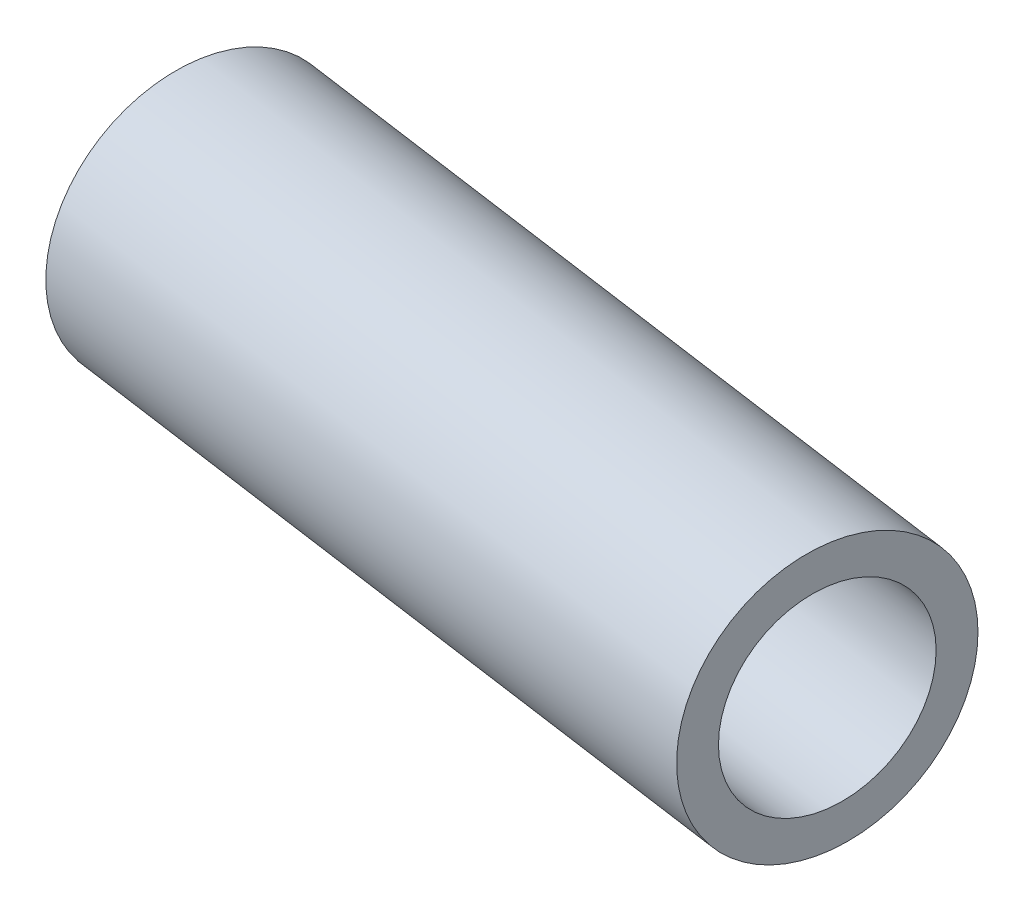
ISO-10303-21;
HEADER;
FILE_DESCRIPTION(('STEP AP214'),'2;1');
FILE_NAME('part.step','',(''),(''),'','','');
FILE_SCHEMA(('AUTOMOTIVE_DESIGN { 1 0 10303 214 1 1 1 1 }'));
ENDSEC;
DATA;
#1=APPLICATION_CONTEXT('core data for automotive mechanical design processes');
#2=APPLICATION_PROTOCOL_DEFINITION('international standard','automotive_design',2000,#1);
#3=PRODUCT_CONTEXT('',#1,'mechanical');
#4=PRODUCT('Part','Part','',(#3));
#5=PRODUCT_RELATED_PRODUCT_CATEGORY('part','',(#4));
#6=PRODUCT_DEFINITION_FORMATION('','',#4);
#7=PRODUCT_DEFINITION_CONTEXT('part definition',#1,'design');
#8=PRODUCT_DEFINITION('design','',#6,#7);
#9=PRODUCT_DEFINITION_SHAPE('','',#8);
#10=(LENGTH_UNIT() NAMED_UNIT(*) SI_UNIT(.MILLI.,.METRE.));
#11=(NAMED_UNIT(*) PLANE_ANGLE_UNIT() SI_UNIT($,.RADIAN.));
#12=(NAMED_UNIT(*) SI_UNIT($,.STERADIAN.) SOLID_ANGLE_UNIT());
#13=UNCERTAINTY_MEASURE_WITH_UNIT(LENGTH_MEASURE(1.E-05),#10,'distance_accuracy_value','');
#14=(GEOMETRIC_REPRESENTATION_CONTEXT(3) GLOBAL_UNCERTAINTY_ASSIGNED_CONTEXT((#13)) GLOBAL_UNIT_ASSIGNED_CONTEXT((#10,
#11,#12)) REPRESENTATION_CONTEXT('',''));
#15=CARTESIAN_POINT('',(0.,0.,0.));
#16=DIRECTION('',(0.,0.,1.));
#17=DIRECTION('',(1.,0.,0.));
#18=AXIS2_PLACEMENT_3D('',#15,#16,#17);
#19=CARTESIAN_POINT('',(-68.2944341838773,-23.74921875,-426.218870209722));
#20=DIRECTION('',(0.990268068741571,0.,0.139173100960058));
#21=DIRECTION('',(0.139173100960058,0.,-0.990268068741571));
#22=AXIS2_PLACEMENT_3D('',#19,#20,#21);
#23=CYLINDRICAL_SURFACE('',#22,5.40078125001179);
#24=CARTESIAN_POINT('',(-68.2944341838773,-23.74921875,-426.218870209722));
#25=DIRECTION('',(0.990268068741571,0.,0.139173100960058));
#26=DIRECTION('',(0.139173100960058,0.,-0.990268068741571));
#27=AXIS2_PLACEMENT_3D('',#24,#25,#26);
#28=CIRCLE('',#27,5.40078125001179);
#29=CARTESIAN_POINT('',(-67.5427907097062,-23.74921875,-431.567091427866));
#30=VERTEX_POINT('',#29);
#31=EDGE_CURVE('E11',#30,#30,#28,.T.);
#32=ORIENTED_EDGE('',*,*,#31,.T.);
#33=EDGE_LOOP('',(#32));
#34=FACE_BOUND('',#33,.T.);
#35=CARTESIAN_POINT('',(-38.5863921216302,-23.74921875,-422.04367718092));
#36=DIRECTION('',(0.990268068741571,0.,0.139173100960058));
#37=DIRECTION('',(0.139173100960058,0.,-0.990268068741571));
#38=AXIS2_PLACEMENT_3D('',#35,#36,#37);
#39=CIRCLE('',#38,5.40078125001179);
#40=CARTESIAN_POINT('',(-37.8347486474591,-23.74921875,-427.391898399065));
#41=VERTEX_POINT('',#40);
#42=EDGE_CURVE('E48',#41,#41,#39,.T.);
#43=ORIENTED_EDGE('',*,*,#42,.F.);
#44=EDGE_LOOP('',(#43));
#45=FACE_BOUND('',#44,.T.);
#46=ADVANCED_FACE('F45',(#34,#45),#23,.T.);
#47=CARTESIAN_POINT('',(-68.2944341838773,-23.74921875,-426.218870209722));
#48=DIRECTION('',(0.990268068741571,0.,0.139173100960058));
#49=DIRECTION('',(0.139173100960058,0.,-0.990268068741571));
#50=AXIS2_PLACEMENT_3D('',#47,#48,#49);
#51=PLANE('',#50);
#52=CARTESIAN_POINT('',(-68.2944341838773,-23.74921875,-426.218870209722));
#53=DIRECTION('',(0.990268068741571,0.,0.139173100960058));
#54=DIRECTION('',(0.139173100960058,0.,-0.990268068741571));
#55=AXIS2_PLACEMENT_3D('',#52,#53,#54);
#56=CIRCLE('',#55,3.90078124999991);
#57=CARTESIAN_POINT('',(-67.751550361148,-23.74921875,-430.081689324742));
#58=VERTEX_POINT('',#57);
#59=EDGE_CURVE('E55',#58,#58,#56,.T.);
#60=ORIENTED_EDGE('',*,*,#59,.T.);
#61=EDGE_LOOP('',(#60));
#62=FACE_BOUND('',#61,.T.);
#63=ORIENTED_EDGE('',*,*,#31,.F.);
#64=EDGE_LOOP('',(#63));
#65=FACE_BOUND('',#64,.T.);
#66=ADVANCED_FACE('F63',(#62,#65),#51,.F.);
#67=CARTESIAN_POINT('',(-38.5863921216302,-23.74921875,-422.04367718092));
#68=DIRECTION('',(0.990268068741571,0.,0.139173100960058));
#69=DIRECTION('',(0.139173100960058,0.,-0.990268068741571));
#70=AXIS2_PLACEMENT_3D('',#67,#68,#69);
#71=PLANE('',#70);
#72=CARTESIAN_POINT('',(-38.5863921216302,-23.74921875,-422.04367718092));
#73=DIRECTION('',(0.990268068741571,0.,0.139173100960058));
#74=DIRECTION('',(0.139173100960058,0.,-0.990268068741571));
#75=AXIS2_PLACEMENT_3D('',#72,#73,#74);
#76=CIRCLE('',#75,3.90078124999991);
#77=CARTESIAN_POINT('',(-38.0435082989008,-23.74921875,-425.906496295941));
#78=VERTEX_POINT('',#77);
#79=EDGE_CURVE('E57',#78,#78,#76,.T.);
#80=ORIENTED_EDGE('',*,*,#79,.F.);
#81=EDGE_LOOP('',(#80));
#82=FACE_BOUND('',#81,.T.);
#83=ORIENTED_EDGE('',*,*,#42,.T.);
#84=EDGE_LOOP('',(#83));
#85=FACE_BOUND('',#84,.T.);
#86=ADVANCED_FACE('F69',(#82,#85),#71,.T.);
#87=CARTESIAN_POINT('',(-68.2944341838773,-23.74921875,-426.218870209722));
#88=DIRECTION('',(0.990268068741571,0.,0.139173100960058));
#89=DIRECTION('',(0.139173100960058,0.,-0.990268068741571));
#90=AXIS2_PLACEMENT_3D('',#87,#88,#89);
#91=CYLINDRICAL_SURFACE('',#90,3.90078124999991);
#92=ORIENTED_EDGE('',*,*,#59,.F.);
#93=EDGE_LOOP('',(#92));
#94=FACE_BOUND('',#93,.T.);
#95=ORIENTED_EDGE('',*,*,#79,.T.);
#96=EDGE_LOOP('',(#95));
#97=FACE_BOUND('',#96,.T.);
#98=ADVANCED_FACE('F66',(#94,#97),#91,.F.);
#99=CLOSED_SHELL('',(#46,#66,#86,#98));
#100=MANIFOLD_SOLID_BREP('B2',#99);
#101=ADVANCED_BREP_SHAPE_REPRESENTATION('',(#18,#100),#14);
#102=SHAPE_DEFINITION_REPRESENTATION(#9,#101);
ENDSEC;
END-ISO-10303-21;
